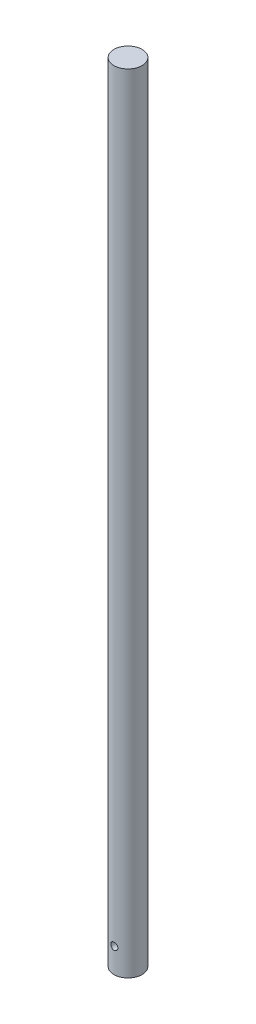
ISO-10303-21;
HEADER;
FILE_DESCRIPTION(('STEP AP214'),'2;1');
FILE_NAME('part.step','',(''),(''),'','','');
FILE_SCHEMA(('AUTOMOTIVE_DESIGN { 1 0 10303 214 1 1 1 1 }'));
ENDSEC;
DATA;
#1=APPLICATION_CONTEXT('core data for automotive mechanical design processes');
#2=APPLICATION_PROTOCOL_DEFINITION('international standard','automotive_design',2000,#1);
#3=PRODUCT_CONTEXT('',#1,'mechanical');
#4=PRODUCT('Part','Part','',(#3));
#5=PRODUCT_RELATED_PRODUCT_CATEGORY('part','',(#4));
#6=PRODUCT_DEFINITION_FORMATION('','',#4);
#7=PRODUCT_DEFINITION_CONTEXT('part definition',#1,'design');
#8=PRODUCT_DEFINITION('design','',#6,#7);
#9=PRODUCT_DEFINITION_SHAPE('','',#8);
#10=(LENGTH_UNIT() NAMED_UNIT(*) SI_UNIT(.MILLI.,.METRE.));
#11=(NAMED_UNIT(*) PLANE_ANGLE_UNIT() SI_UNIT($,.RADIAN.));
#12=(NAMED_UNIT(*) SI_UNIT($,.STERADIAN.) SOLID_ANGLE_UNIT());
#13=UNCERTAINTY_MEASURE_WITH_UNIT(LENGTH_MEASURE(1.E-05),#10,'distance_accuracy_value','');
#14=(GEOMETRIC_REPRESENTATION_CONTEXT(3) GLOBAL_UNCERTAINTY_ASSIGNED_CONTEXT((#13)) GLOBAL_UNIT_ASSIGNED_CONTEXT((#10,
#11,#12)) REPRESENTATION_CONTEXT('',''));
#15=CARTESIAN_POINT('',(0.,0.,0.));
#16=DIRECTION('',(0.,0.,1.));
#17=DIRECTION('',(1.,0.,0.));
#18=AXIS2_PLACEMENT_3D('',#15,#16,#17);
#19=CARTESIAN_POINT('',(0.,177.8,0.));
#20=DIRECTION('',(0.,-1.,0.));
#21=DIRECTION('',(0.,0.,-1.));
#22=AXIS2_PLACEMENT_3D('',#19,#20,#21);
#23=CYLINDRICAL_SURFACE('',#22,6.35);
#24=CARTESIAN_POINT('',(0.,177.8,0.));
#25=DIRECTION('',(0.,1.,0.));
#26=DIRECTION('',(0.,0.,1.));
#27=AXIS2_PLACEMENT_3D('',#24,#25,#26);
#28=CIRCLE('',#27,6.35);
#29=CARTESIAN_POINT('',(0.,177.8,6.35));
#30=VERTEX_POINT('',#29);
#31=EDGE_CURVE('E45',#30,#30,#28,.T.);
#32=ORIENTED_EDGE('',*,*,#31,.F.);
#33=EDGE_LOOP('',(#32));
#34=FACE_BOUND('',#33,.T.);
#35=CARTESIAN_POINT('',(0.,-177.8,0.));
#36=DIRECTION('',(0.,1.,0.));
#37=DIRECTION('',(0.,0.,1.));
#38=AXIS2_PLACEMENT_3D('',#35,#36,#37);
#39=CIRCLE('',#38,6.35);
#40=CARTESIAN_POINT('',(0.,-177.8,6.35));
#41=VERTEX_POINT('',#40);
#42=EDGE_CURVE('E49',#41,#41,#39,.T.);
#43=ORIENTED_EDGE('',*,*,#42,.T.);
#44=EDGE_LOOP('',(#43));
#45=FACE_BOUND('',#44,.T.);
#46=CARTESIAN_POINT('',(0.,-165.1,-6.35));
#47=CARTESIAN_POINT('',(0.0877105271754661,-165.100002461406,-6.34999851693647));
#48=CARTESIAN_POINT('',(0.175448550370892,-165.107293557902,-6.34816461856185));
#49=CARTESIAN_POINT('',(0.348410025990487,-165.136221618467,-6.34102653803303));
#50=CARTESIAN_POINT('',(0.433632024604877,-165.157866713427,-6.335720389028));
#51=CARTESIAN_POINT('',(0.599038756393242,-165.214764876581,-6.32222537868075));
#52=CARTESIAN_POINT('',(0.679229404630101,-165.25000160364,-6.31403998007875));
#53=CARTESIAN_POINT('',(0.832561339598871,-165.333025304464,-6.29565822196369));
#54=CARTESIAN_POINT('',(0.905702388435797,-165.380812701559,-6.28546179462203));
#55=CARTESIAN_POINT('',(1.04436537306017,-165.488620835717,-6.26393012717989));
#56=CARTESIAN_POINT('',(1.109721438648,-165.548851416832,-6.25257731732197));
#57=CARTESIAN_POINT('',(1.22951761462353,-165.679386916862,-6.23012914624385));
#58=CARTESIAN_POINT('',(1.28395649243787,-165.749692971785,-6.21903381421835));
#59=CARTESIAN_POINT('',(1.38115309112902,-165.899671614964,-6.19817970948859));
#60=CARTESIAN_POINT('',(1.42372526185438,-165.979467835941,-6.18844324148056));
#61=CARTESIAN_POINT('',(1.49478672821602,-166.145367069005,-6.17166548676268));
#62=CARTESIAN_POINT('',(1.52327827534001,-166.23146907027,-6.16462376920367));
#63=CARTESIAN_POINT('',(1.56480386895126,-166.405711868931,-6.15421337859407));
#64=CARTESIAN_POINT('',(1.57813615065283,-166.493777264986,-6.15077394721491));
#65=CARTESIAN_POINT('',(1.58989371194686,-166.67095673554,-6.14774575352441));
#66=CARTESIAN_POINT('',(1.58832141675741,-166.760070637073,-6.14815636474813));
#67=CARTESIAN_POINT('',(1.57055240524329,-166.934531729863,-6.15271825817253));
#68=CARTESIAN_POINT('',(1.55471107670168,-167.019917866051,-6.15677863343654));
#69=CARTESIAN_POINT('',(1.50942059780583,-167.186780445548,-6.16803767740944));
#70=CARTESIAN_POINT('',(1.47997047802352,-167.268256609872,-6.17523656968986));
#71=CARTESIAN_POINT('',(1.40799553081686,-167.425939400533,-6.19204495548596));
#72=CARTESIAN_POINT('',(1.36534172282153,-167.502084531811,-6.20167804905136));
#73=CARTESIAN_POINT('',(1.26826039211586,-167.646263967826,-6.22225610645758));
#74=CARTESIAN_POINT('',(1.21383080915605,-167.714296850038,-6.23320129970927));
#75=CARTESIAN_POINT('',(1.09290212445432,-167.842357159943,-6.25555306904601));
#76=CARTESIAN_POINT('',(1.02610312322556,-167.902101001982,-6.26696390197519));
#77=CARTESIAN_POINT('',(0.883297612691445,-168.009592481608,-6.28867980237548));
#78=CARTESIAN_POINT('',(0.807290822240937,-168.057339752762,-6.29898483606464));
#79=CARTESIAN_POINT('',(0.647822648854503,-168.139586870421,-6.31737933133009));
#80=CARTESIAN_POINT('',(0.564336557812489,-168.174040651769,-6.32546106135175));
#81=CARTESIAN_POINT('',(0.392510441951239,-168.228345815209,-6.33844212149251));
#82=CARTESIAN_POINT('',(0.304171349100944,-168.248199990543,-6.34334206034072));
#83=CARTESIAN_POINT('',(0.127571468662784,-168.272309256883,-6.34931736728871));
#84=CARTESIAN_POINT('',(0.0393665286541922,-168.27695053593,-6.35048739962928));
#85=CARTESIAN_POINT('',(-0.136559792498264,-168.271561472825,-6.34914068428627));
#86=CARTESIAN_POINT('',(-0.224281216457201,-168.261532451371,-6.34662426847621));
#87=CARTESIAN_POINT('',(-0.395408434455133,-168.227405788619,-6.33824806693119));
#88=CARTESIAN_POINT('',(-0.478858917575283,-168.203518829487,-6.3324383784665));
#89=CARTESIAN_POINT('',(-0.640563967845598,-168.142595002737,-6.31813047854458));
#90=CARTESIAN_POINT('',(-0.718818009309564,-168.105556807102,-6.30963199558136));
#91=CARTESIAN_POINT('',(-0.869445317271612,-168.018633430274,-6.29066250888678));
#92=CARTESIAN_POINT('',(-0.941689592609606,-167.968531947713,-6.28015917963336));
#93=CARTESIAN_POINT('',(-1.07688233277246,-167.857180679857,-6.25839605556685));
#94=CARTESIAN_POINT('',(-1.13982918991313,-167.795928970572,-6.24713613041387));
#95=CARTESIAN_POINT('',(-1.25623168454368,-167.662222924773,-6.22478812783482));
#96=CARTESIAN_POINT('',(-1.3094164265667,-167.589530514322,-6.21371105264871));
#97=CARTESIAN_POINT('',(-1.40283221995515,-167.436024628524,-6.1932912961591));
#98=CARTESIAN_POINT('',(-1.4430638463172,-167.355211513868,-6.18394853787601));
#99=CARTESIAN_POINT('',(-1.50913192014488,-167.188191443779,-6.16815816927519));
#100=CARTESIAN_POINT('',(-1.53505365312559,-167.102019926669,-6.16169345183932));
#101=CARTESIAN_POINT('',(-1.57199082345113,-166.926355633234,-6.15237470828776));
#102=CARTESIAN_POINT('',(-1.5830095207483,-166.836863587657,-6.14951989253598));
#103=CARTESIAN_POINT('',(-1.58965750810353,-166.659855249753,-6.1478043710752));
#104=CARTESIAN_POINT('',(-1.58571977515067,-166.572356047826,-6.14883128804078));
#105=CARTESIAN_POINT('',(-1.56355761954783,-166.399311717826,-6.15450370366632));
#106=CARTESIAN_POINT('',(-1.54533348401021,-166.313766550519,-6.15914912960547));
#107=CARTESIAN_POINT('',(-1.495352313077,-166.147529380822,-6.17147250889214));
#108=CARTESIAN_POINT('',(-1.46367648662011,-166.066811518621,-6.17913224458426));
#109=CARTESIAN_POINT('',(-1.38775536689874,-165.911778303295,-6.19662374808776));
#110=CARTESIAN_POINT('',(-1.34350833028623,-165.837463840044,-6.2064558171115));
#111=CARTESIAN_POINT('',(-1.24234336730768,-165.695254684306,-6.22750462928883));
#112=CARTESIAN_POINT('',(-1.18512501408218,-165.627578030626,-6.23875080280275));
#113=CARTESIAN_POINT('',(-1.06022708450918,-165.502646044258,-6.26118495502318));
#114=CARTESIAN_POINT('',(-0.992545027501424,-165.445393189797,-6.27237291927804));
#115=CARTESIAN_POINT('',(-0.847161529260281,-165.341923031769,-6.29367185560443));
#116=CARTESIAN_POINT('',(-0.769300830284881,-165.295924367198,-6.3037596531221));
#117=CARTESIAN_POINT('',(-0.606706579648618,-165.217742268388,-6.32147712265333));
#118=CARTESIAN_POINT('',(-0.521978004637241,-165.18554893498,-6.32910855503102));
#119=CARTESIAN_POINT('',(-0.364500851349356,-165.140669812901,-6.33992529706865));
#120=CARTESIAN_POINT('',(-0.292502347544383,-165.125451601102,-6.34367735847431));
#121=CARTESIAN_POINT('',(-0.147008925709237,-165.105116043,-6.34871523870479));
#122=CARTESIAN_POINT('',(-0.0735141206484377,-165.099997936985,-6.35000124302196));
#123=CARTESIAN_POINT('',(0.,-165.1,-6.35));
#124=B_SPLINE_CURVE_WITH_KNOTS('',3,(#46,#47,#48,#49,#50,#51,#52,#53,#54,#55,#56,#57,#58,#59,
#60,#61,#62,#63,#64,#65,#66,#67,#68,#69,#70,#71,#72,#73,#74,#75,#76,#77,#78,#79,#80,#81,#82,#83,
#84,#85,#86,#87,#88,#89,#90,#91,#92,#93,#94,#95,#96,#97,#98,#99,#100,#101,#102,#103,#104,#105,
#106,#107,#108,#109,#110,#111,#112,#113,#114,#115,#116,#117,#118,#119,#120,#121,#122,#123),
.UNSPECIFIED.,.T.,.F.,(4,2,2,2,2,2,2,2,2,2,2,2,2,2,2,2,2,2,2,2,2,2,2,2,2,2,2,2,2,2,2,2,2,2,2,2,
2,2,4),(0.,0.262862179032753,0.525873384966814,0.788569354919485,1.05127418667924,
1.31883610837642,1.58642822138902,1.85799568652652,2.12951971404257,2.39560412313571,
2.66164523669279,2.92123809332437,3.18084944501569,3.44308141999867,3.70535931134952,
3.97511588525558,4.2448806978249,4.51557209034659,4.78621167987161,5.04992543638,
5.31361545344336,5.57339790527374,5.83320659749442,6.09762546840016,6.36209000850173,
6.6330460557476,6.90399007343251,7.17330136133208,7.44255372942155,7.70407167588554,
7.96558436678496,8.22554023925441,8.48553217944913,8.75230635033848,9.01914386340385,
9.29081396320425,9.56228893377625,9.78262207113806,10.0029386347892),.UNSPECIFIED.);
#125=CARTESIAN_POINT('',(0.,-165.1,-6.35));
#126=VERTEX_POINT('',#125);
#127=EDGE_CURVE('E41',#126,#126,#124,.T.);
#128=ORIENTED_EDGE('',*,*,#127,.F.);
#129=EDGE_LOOP('',(#128));
#130=FACE_BOUND('',#129,.T.);
#131=CARTESIAN_POINT('',(0.,-168.275,6.35));
#132=CARTESIAN_POINT('',(0.087710527175468,-168.274997538594,6.34999851693647));
#133=CARTESIAN_POINT('',(0.175448550370896,-168.267706442098,6.34816461856185));
#134=CARTESIAN_POINT('',(0.348410025990491,-168.238778381533,6.34102653803303));
#135=CARTESIAN_POINT('',(0.433632024604879,-168.217133286572,6.335720389028));
#136=CARTESIAN_POINT('',(0.599038756393242,-168.160235123419,6.32222537868075));
#137=CARTESIAN_POINT('',(0.679229404630101,-168.12499839636,6.31403998007875));
#138=CARTESIAN_POINT('',(0.832561339598871,-168.041974695536,6.29565822196369));
#139=CARTESIAN_POINT('',(0.905702388435797,-167.994187298441,6.28546179462203));
#140=CARTESIAN_POINT('',(1.04436537306017,-167.886379164283,6.26393012717989));
#141=CARTESIAN_POINT('',(1.109721438648,-167.826148583168,6.25257731732197));
#142=CARTESIAN_POINT('',(1.22951761462353,-167.695613083138,6.23012914624385));
#143=CARTESIAN_POINT('',(1.28395649243787,-167.625307028215,6.21903381421835));
#144=CARTESIAN_POINT('',(1.38115309112902,-167.475328385036,6.19817970948859));
#145=CARTESIAN_POINT('',(1.42372526185438,-167.395532164059,6.18844324148056));
#146=CARTESIAN_POINT('',(1.49478672821602,-167.229632930995,6.17166548676268));
#147=CARTESIAN_POINT('',(1.52327827534001,-167.14353092973,6.16462376920367));
#148=CARTESIAN_POINT('',(1.56480386895126,-166.969288131069,6.15421337859407));
#149=CARTESIAN_POINT('',(1.57813615065283,-166.881222735014,6.15077394721491));
#150=CARTESIAN_POINT('',(1.58989371194686,-166.70404326446,6.14774575352441));
#151=CARTESIAN_POINT('',(1.58832141675741,-166.614929362927,6.14815636474813));
#152=CARTESIAN_POINT('',(1.57055240524329,-166.440468270137,6.15271825817253));
#153=CARTESIAN_POINT('',(1.55471107670168,-166.355082133949,6.15677863343654));
#154=CARTESIAN_POINT('',(1.50942059780583,-166.188219554452,6.16803767740944));
#155=CARTESIAN_POINT('',(1.47997047802351,-166.106743390128,6.17523656968986));
#156=CARTESIAN_POINT('',(1.40799553081686,-165.949060599467,6.19204495548596));
#157=CARTESIAN_POINT('',(1.36534172282153,-165.872915468189,6.20167804905136));
#158=CARTESIAN_POINT('',(1.26826039211586,-165.728736032174,6.22225610645758));
#159=CARTESIAN_POINT('',(1.21383080915605,-165.660703149962,6.23320129970927));
#160=CARTESIAN_POINT('',(1.09290212445432,-165.532642840057,6.25555306904601));
#161=CARTESIAN_POINT('',(1.02610312322556,-165.472898998018,6.26696390197519));
#162=CARTESIAN_POINT('',(0.883297612691445,-165.365407518392,6.28867980237548));
#163=CARTESIAN_POINT('',(0.807290822240937,-165.317660247238,6.29898483606464));
#164=CARTESIAN_POINT('',(0.647822648854503,-165.235413129579,6.31737933133009));
#165=CARTESIAN_POINT('',(0.564336557812489,-165.200959348231,6.32546106135175));
#166=CARTESIAN_POINT('',(0.392510441951239,-165.146654184791,6.33844212149251));
#167=CARTESIAN_POINT('',(0.304171349100944,-165.126800009457,6.34334206034072));
#168=CARTESIAN_POINT('',(0.127571468662784,-165.102690743117,6.34931736728871));
#169=CARTESIAN_POINT('',(0.0393665286541916,-165.09804946407,6.35048739962928));
#170=CARTESIAN_POINT('',(-0.136559792498265,-165.103438527175,6.34914068428627));
#171=CARTESIAN_POINT('',(-0.224281216457201,-165.113467548629,6.34662426847621));
#172=CARTESIAN_POINT('',(-0.395408434455133,-165.147594211381,6.33824806693119));
#173=CARTESIAN_POINT('',(-0.478858917575283,-165.171481170513,6.3324383784665));
#174=CARTESIAN_POINT('',(-0.640563967845598,-165.232404997263,6.31813047854458));
#175=CARTESIAN_POINT('',(-0.718818009309562,-165.269443192898,6.30963199558136));
#176=CARTESIAN_POINT('',(-0.86944531727162,-165.356366569726,6.29066250888678));
#177=CARTESIAN_POINT('',(-0.941689592609627,-165.406468052286,6.28015917963336));
#178=CARTESIAN_POINT('',(-1.07688233277248,-165.517819320143,6.25839605556685));
#179=CARTESIAN_POINT('',(-1.13982918991314,-165.579071029428,6.24713613041387));
#180=CARTESIAN_POINT('',(-1.25623168454368,-165.712777075227,6.22478812783482));
#181=CARTESIAN_POINT('',(-1.30941642656669,-165.785469485678,6.21371105264872));
#182=CARTESIAN_POINT('',(-1.40283221995515,-165.938975371476,6.1932912961591));
#183=CARTESIAN_POINT('',(-1.4430638463172,-166.019788486132,6.18394853787601));
#184=CARTESIAN_POINT('',(-1.50913192014489,-166.18680855622,6.16815816927519));
#185=CARTESIAN_POINT('',(-1.5350536531256,-166.272980073331,6.16169345183932));
#186=CARTESIAN_POINT('',(-1.57199082345113,-166.448644366766,6.15237470828776));
#187=CARTESIAN_POINT('',(-1.5830095207483,-166.538136412343,6.14951989253598));
#188=CARTESIAN_POINT('',(-1.58965750810353,-166.715144750247,6.14780437107519));
#189=CARTESIAN_POINT('',(-1.58571977515067,-166.802643952174,6.14883128804078));
#190=CARTESIAN_POINT('',(-1.56355761954783,-166.975688282174,6.15450370366632));
#191=CARTESIAN_POINT('',(-1.54533348401021,-167.061233449481,6.15914912960547));
#192=CARTESIAN_POINT('',(-1.495352313077,-167.227470619178,6.17147250889214));
#193=CARTESIAN_POINT('',(-1.46367648662011,-167.308188481379,6.17913224458426));
#194=CARTESIAN_POINT('',(-1.38775536689874,-167.463221696705,6.19662374808776));
#195=CARTESIAN_POINT('',(-1.34350833028623,-167.537536159956,6.2064558171115));
#196=CARTESIAN_POINT('',(-1.24234336730768,-167.679745315694,6.22750462928883));
#197=CARTESIAN_POINT('',(-1.18512501408218,-167.747421969374,6.23875080280275));
#198=CARTESIAN_POINT('',(-1.06022708450918,-167.872353955742,6.26118495502318));
#199=CARTESIAN_POINT('',(-0.992545027501424,-167.929606810203,6.27237291927804));
#200=CARTESIAN_POINT('',(-0.847161529260281,-168.033076968231,6.29367185560443));
#201=CARTESIAN_POINT('',(-0.769300830284881,-168.079075632802,6.3037596531221));
#202=CARTESIAN_POINT('',(-0.606706579648618,-168.157257731612,6.32147712265333));
#203=CARTESIAN_POINT('',(-0.521978004637241,-168.18945106502,6.32910855503102));
#204=CARTESIAN_POINT('',(-0.364500851349358,-168.234330187099,6.33992529706865));
#205=CARTESIAN_POINT('',(-0.292502347544386,-168.249548398898,6.34367735847431));
#206=CARTESIAN_POINT('',(-0.14700892570924,-168.269883957,6.34871523870479));
#207=CARTESIAN_POINT('',(-0.0735141206484393,-168.275002063015,6.35000124302196));
#208=CARTESIAN_POINT('',(0.,-168.275,6.35));
#209=B_SPLINE_CURVE_WITH_KNOTS('',3,(#131,#132,#133,#134,#135,#136,#137,#138,#139,#140,#141,
#142,#143,#144,#145,#146,#147,#148,#149,#150,#151,#152,#153,#154,#155,#156,#157,#158,#159,#160,
#161,#162,#163,#164,#165,#166,#167,#168,#169,#170,#171,#172,#173,#174,#175,#176,#177,#178,#179,
#180,#181,#182,#183,#184,#185,#186,#187,#188,#189,#190,#191,#192,#193,#194,#195,#196,#197,#198,
#199,#200,#201,#202,#203,#204,#205,#206,#207,#208),.UNSPECIFIED.,.T.,.F.,(4,2,2,2,2,2,2,2,2,2,2,
2,2,2,2,2,2,2,2,2,2,2,2,2,2,2,2,2,2,2,2,2,2,2,2,2,2,2,4),(0.,0.262862179032756,
0.525873384966812,0.788569354919483,1.05127418667923,1.31883610837642,1.58642822138902,
1.85799568652652,2.12951971404257,2.39560412313571,2.66164523669279,2.92123809332439,
3.18084944501569,3.44308141999867,3.70535931134951,3.97511588525558,4.2448806978249,
4.51557209034659,4.78621167987161,5.04992543637999,5.31361545344336,5.57339790527374,
5.83320659749442,6.09762546840018,6.36209000850173,6.6330460557476,6.90399007343251,
7.17330136133214,7.44255372942155,7.70407167588554,7.96558436678496,8.22554023925442,
8.48553217944914,8.75230635033848,9.01914386340385,9.29081396320425,9.56228893377625,
9.78262207113805,10.0029386347892),.UNSPECIFIED.);
#210=CARTESIAN_POINT('',(0.,-168.275,6.35));
#211=VERTEX_POINT('',#210);
#212=EDGE_CURVE('E10',#211,#211,#209,.T.);
#213=ORIENTED_EDGE('',*,*,#212,.F.);
#214=EDGE_LOOP('',(#213));
#215=FACE_BOUND('',#214,.T.);
#216=ADVANCED_FACE('F31',(#34,#45,#130,#215),#23,.T.);
#217=CARTESIAN_POINT('',(0.,177.8,0.));
#218=DIRECTION('',(0.,1.,0.));
#219=DIRECTION('',(0.,0.,1.));
#220=AXIS2_PLACEMENT_3D('',#217,#218,#219);
#221=PLANE('',#220);
#222=ORIENTED_EDGE('',*,*,#31,.T.);
#223=EDGE_LOOP('',(#222));
#224=FACE_BOUND('',#223,.T.);
#225=ADVANCED_FACE('F59',(#224),#221,.T.);
#226=CARTESIAN_POINT('',(0.,-177.8,0.));
#227=DIRECTION('',(0.,1.,0.));
#228=DIRECTION('',(0.,0.,1.));
#229=AXIS2_PLACEMENT_3D('',#226,#227,#228);
#230=PLANE('',#229);
#231=ORIENTED_EDGE('',*,*,#42,.F.);
#232=EDGE_LOOP('',(#231));
#233=FACE_BOUND('',#232,.T.);
#234=ADVANCED_FACE('F58',(#233),#230,.F.);
#235=CARTESIAN_POINT('',(0.,-166.6875,6.35));
#236=DIRECTION('',(0.,0.,-1.));
#237=DIRECTION('',(-1.,0.,0.));
#238=AXIS2_PLACEMENT_3D('',#235,#236,#237);
#239=CYLINDRICAL_SURFACE('',#238,1.58750000000005);
#240=ORIENTED_EDGE('',*,*,#212,.T.);
#241=EDGE_LOOP('',(#240));
#242=FACE_BOUND('',#241,.T.);
#243=ORIENTED_EDGE('',*,*,#127,.T.);
#244=EDGE_LOOP('',(#243));
#245=FACE_BOUND('',#244,.T.);
#246=ADVANCED_FACE('F54',(#242,#245),#239,.F.);
#247=CLOSED_SHELL('',(#216,#225,#234,#246));
#248=MANIFOLD_SOLID_BREP('B2',#247);
#249=ADVANCED_BREP_SHAPE_REPRESENTATION('',(#18,#248),#14);
#250=SHAPE_DEFINITION_REPRESENTATION(#9,#249);
ENDSEC;
END-ISO-10303-21;
